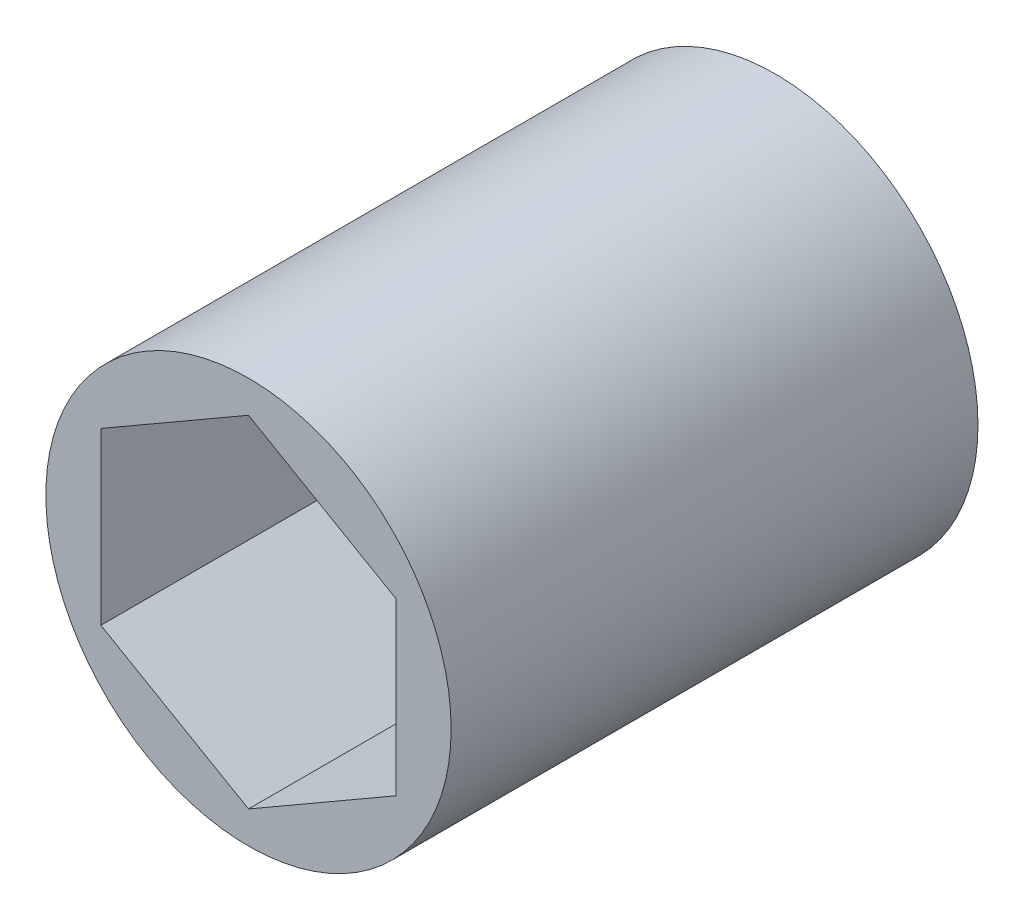
ISO-10303-21;
HEADER;
FILE_DESCRIPTION(('STEP AP214'),'2;1');
FILE_NAME('part.step','',(''),(''),'','','');
FILE_SCHEMA(('AUTOMOTIVE_DESIGN { 1 0 10303 214 1 1 1 1 }'));
ENDSEC;
DATA;
#1=APPLICATION_CONTEXT('core data for automotive mechanical design processes');
#2=APPLICATION_PROTOCOL_DEFINITION('international standard','automotive_design',2000,#1);
#3=PRODUCT_CONTEXT('',#1,'mechanical');
#4=PRODUCT('Part','Part','',(#3));
#5=PRODUCT_RELATED_PRODUCT_CATEGORY('part','',(#4));
#6=PRODUCT_DEFINITION_FORMATION('','',#4);
#7=PRODUCT_DEFINITION_CONTEXT('part definition',#1,'design');
#8=PRODUCT_DEFINITION('design','',#6,#7);
#9=PRODUCT_DEFINITION_SHAPE('','',#8);
#10=(LENGTH_UNIT() NAMED_UNIT(*) SI_UNIT(.MILLI.,.METRE.));
#11=(NAMED_UNIT(*) PLANE_ANGLE_UNIT() SI_UNIT($,.RADIAN.));
#12=(NAMED_UNIT(*) SI_UNIT($,.STERADIAN.) SOLID_ANGLE_UNIT());
#13=UNCERTAINTY_MEASURE_WITH_UNIT(LENGTH_MEASURE(1.E-05),#10,'distance_accuracy_value','');
#14=(GEOMETRIC_REPRESENTATION_CONTEXT(3) GLOBAL_UNCERTAINTY_ASSIGNED_CONTEXT((#13)) GLOBAL_UNIT_ASSIGNED_CONTEXT((#10,
#11,#12)) REPRESENTATION_CONTEXT('',''));
#15=CARTESIAN_POINT('',(0.,0.,0.));
#16=DIRECTION('',(0.,0.,1.));
#17=DIRECTION('',(1.,0.,0.));
#18=AXIS2_PLACEMENT_3D('',#15,#16,#17);
#19=CARTESIAN_POINT('',(0.,0.,23.114));
#20=DIRECTION('',(0.,0.,1.));
#21=DIRECTION('',(1.,0.,0.));
#22=AXIS2_PLACEMENT_3D('',#19,#20,#21);
#23=PLANE('',#22);
#24=CARTESIAN_POINT('',(0.,0.,23.114));
#25=DIRECTION('',(0.,0.,1.));
#26=DIRECTION('',(1.,0.,0.));
#27=AXIS2_PLACEMENT_3D('',#24,#25,#26);
#28=CIRCLE('',#27,8.89);
#29=CARTESIAN_POINT('',(8.89,0.,23.114));
#30=VERTEX_POINT('',#29);
#31=EDGE_CURVE('E11',#30,#30,#28,.T.);
#32=ORIENTED_EDGE('',*,*,#31,.T.);
#33=EDGE_LOOP('',(#32));
#34=FACE_BOUND('',#33,.T.);
#35=DIRECTION('',(-0.866025403784439,-0.5,0.));
#36=VECTOR('',#35,1.);
#37=CARTESIAN_POINT('',(0.,7.47899538708242,23.114));
#38=LINE('',#37,#36);
#39=CARTESIAN_POINT('',(0.,7.47899538708242,23.114));
#40=VERTEX_POINT('',#39);
#41=CARTESIAN_POINT('',(-6.477,3.73949769354121,23.114));
#42=VERTEX_POINT('',#41);
#43=EDGE_CURVE('E93',#40,#42,#38,.T.);
#44=ORIENTED_EDGE('',*,*,#43,.F.);
#45=DIRECTION('',(-0.866025403784439,0.5,0.));
#46=VECTOR('',#45,1.);
#47=CARTESIAN_POINT('',(6.477,3.73949769354121,23.114));
#48=LINE('',#47,#46);
#49=CARTESIAN_POINT('',(6.477,3.73949769354121,23.114));
#50=VERTEX_POINT('',#49);
#51=EDGE_CURVE('E85',#50,#40,#48,.T.);
#52=ORIENTED_EDGE('',*,*,#51,.F.);
#53=DIRECTION('',(0.,1.,0.));
#54=VECTOR('',#53,1.);
#55=CARTESIAN_POINT('',(6.477,-3.73949769354121,23.114));
#56=LINE('',#55,#54);
#57=CARTESIAN_POINT('',(6.477,-3.73949769354121,23.114));
#58=VERTEX_POINT('',#57);
#59=EDGE_CURVE('E113',#58,#50,#56,.T.);
#60=ORIENTED_EDGE('',*,*,#59,.F.);
#61=DIRECTION('',(0.866025403784439,0.5,0.));
#62=VECTOR('',#61,1.);
#63=CARTESIAN_POINT('',(0.,-7.47899538708241,23.114));
#64=LINE('',#63,#62);
#65=CARTESIAN_POINT('',(0.,-7.47899538708241,23.114));
#66=VERTEX_POINT('',#65);
#67=EDGE_CURVE('E111',#66,#58,#64,.T.);
#68=ORIENTED_EDGE('',*,*,#67,.F.);
#69=DIRECTION('',(0.866025403784439,-0.5,0.));
#70=VECTOR('',#69,1.);
#71=CARTESIAN_POINT('',(-6.477,-3.73949769354121,23.114));
#72=LINE('',#71,#70);
#73=CARTESIAN_POINT('',(-6.477,-3.73949769354121,23.114));
#74=VERTEX_POINT('',#73);
#75=EDGE_CURVE('E107',#74,#66,#72,.T.);
#76=ORIENTED_EDGE('',*,*,#75,.F.);
#77=DIRECTION('',(0.,-1.,0.));
#78=VECTOR('',#77,1.);
#79=CARTESIAN_POINT('',(-6.477,3.73949769354121,23.114));
#80=LINE('',#79,#78);
#81=EDGE_CURVE('E105',#42,#74,#80,.T.);
#82=ORIENTED_EDGE('',*,*,#81,.F.);
#83=EDGE_LOOP('',(#44,#52,#60,#68,#76,#82));
#84=FACE_BOUND('',#83,.T.);
#85=ADVANCED_FACE('F32',(#34,#84),#23,.T.);
#86=CARTESIAN_POINT('',(0.,0.,0.));
#87=DIRECTION('',(0.,0.,1.));
#88=DIRECTION('',(1.,0.,0.));
#89=AXIS2_PLACEMENT_3D('',#86,#87,#88);
#90=PLANE('',#89);
#91=CARTESIAN_POINT('',(0.,0.,0.));
#92=DIRECTION('',(0.,0.,1.));
#93=DIRECTION('',(1.,0.,0.));
#94=AXIS2_PLACEMENT_3D('',#91,#92,#93);
#95=CIRCLE('',#94,8.89);
#96=CARTESIAN_POINT('',(8.89,0.,0.));
#97=VERTEX_POINT('',#96);
#98=EDGE_CURVE('E36',#97,#97,#95,.T.);
#99=ORIENTED_EDGE('',*,*,#98,.F.);
#100=EDGE_LOOP('',(#99));
#101=FACE_BOUND('',#100,.T.);
#102=DIRECTION('',(-0.866025403784439,0.5,0.));
#103=VECTOR('',#102,1.);
#104=CARTESIAN_POINT('',(6.477,3.73949769354121,0.));
#105=LINE('',#104,#103);
#106=CARTESIAN_POINT('',(6.477,3.73949769354121,0.));
#107=VERTEX_POINT('',#106);
#108=CARTESIAN_POINT('',(0.,7.47899538708242,0.));
#109=VERTEX_POINT('',#108);
#110=EDGE_CURVE('E55',#107,#109,#105,.T.);
#111=ORIENTED_EDGE('',*,*,#110,.T.);
#112=DIRECTION('',(-0.866025403784439,-0.5,0.));
#113=VECTOR('',#112,1.);
#114=CARTESIAN_POINT('',(0.,7.47899538708242,0.));
#115=LINE('',#114,#113);
#116=CARTESIAN_POINT('',(-6.477,3.73949769354121,0.));
#117=VERTEX_POINT('',#116);
#118=EDGE_CURVE('E100',#109,#117,#115,.T.);
#119=ORIENTED_EDGE('',*,*,#118,.T.);
#120=DIRECTION('',(0.,-1.,0.));
#121=VECTOR('',#120,1.);
#122=CARTESIAN_POINT('',(-6.477,3.73949769354121,0.));
#123=LINE('',#122,#121);
#124=CARTESIAN_POINT('',(-6.477,-3.73949769354121,0.));
#125=VERTEX_POINT('',#124);
#126=EDGE_CURVE('E117',#117,#125,#123,.T.);
#127=ORIENTED_EDGE('',*,*,#126,.T.);
#128=DIRECTION('',(0.866025403784439,-0.5,0.));
#129=VECTOR('',#128,1.);
#130=CARTESIAN_POINT('',(-6.477,-3.73949769354121,0.));
#131=LINE('',#130,#129);
#132=CARTESIAN_POINT('',(0.,-7.47899538708241,0.));
#133=VERTEX_POINT('',#132);
#134=EDGE_CURVE('E120',#125,#133,#131,.T.);
#135=ORIENTED_EDGE('',*,*,#134,.T.);
#136=DIRECTION('',(0.866025403784439,0.5,0.));
#137=VECTOR('',#136,1.);
#138=CARTESIAN_POINT('',(0.,-7.47899538708241,0.));
#139=LINE('',#138,#137);
#140=CARTESIAN_POINT('',(6.477,-3.73949769354121,0.));
#141=VERTEX_POINT('',#140);
#142=EDGE_CURVE('E123',#133,#141,#139,.T.);
#143=ORIENTED_EDGE('',*,*,#142,.T.);
#144=DIRECTION('',(0.,1.,0.));
#145=VECTOR('',#144,1.);
#146=CARTESIAN_POINT('',(6.477,-3.73949769354121,0.));
#147=LINE('',#146,#145);
#148=EDGE_CURVE('E94',#141,#107,#147,.T.);
#149=ORIENTED_EDGE('',*,*,#148,.T.);
#150=EDGE_LOOP('',(#111,#119,#127,#135,#143,#149));
#151=FACE_BOUND('',#150,.T.);
#152=ADVANCED_FACE('F140',(#101,#151),#90,.F.);
#153=CARTESIAN_POINT('',(0.,0.,23.114));
#154=DIRECTION('',(0.,0.,-1.));
#155=DIRECTION('',(-1.,0.,0.));
#156=AXIS2_PLACEMENT_3D('',#153,#154,#155);
#157=CYLINDRICAL_SURFACE('',#156,8.89);
#158=ORIENTED_EDGE('',*,*,#31,.F.);
#159=EDGE_LOOP('',(#158));
#160=FACE_BOUND('',#159,.T.);
#161=ORIENTED_EDGE('',*,*,#98,.T.);
#162=EDGE_LOOP('',(#161));
#163=FACE_BOUND('',#162,.T.);
#164=ADVANCED_FACE('F34',(#160,#163),#157,.T.);
#165=CARTESIAN_POINT('',(6.477,3.73949769354121,23.114));
#166=DIRECTION('',(-0.5,-0.866025403784439,0.));
#167=DIRECTION('',(0.866025403784439,-0.5,0.));
#168=AXIS2_PLACEMENT_3D('',#165,#166,#167);
#169=PLANE('',#168);
#170=ORIENTED_EDGE('',*,*,#110,.F.);
#171=DIRECTION('',(0.,0.,-1.));
#172=VECTOR('',#171,1.);
#173=CARTESIAN_POINT('',(6.477,3.73949769354121,23.114));
#174=LINE('',#173,#172);
#175=EDGE_CURVE('E89',#50,#107,#174,.T.);
#176=ORIENTED_EDGE('',*,*,#175,.F.);
#177=ORIENTED_EDGE('',*,*,#51,.T.);
#178=DIRECTION('',(0.,0.,-1.));
#179=VECTOR('',#178,1.);
#180=CARTESIAN_POINT('',(0.,7.47899538708242,23.114));
#181=LINE('',#180,#179);
#182=EDGE_CURVE('E88',#40,#109,#181,.T.);
#183=ORIENTED_EDGE('',*,*,#182,.T.);
#184=EDGE_LOOP('',(#170,#176,#177,#183));
#185=FACE_BOUND('',#184,.T.);
#186=ADVANCED_FACE('F87',(#185),#169,.T.);
#187=CARTESIAN_POINT('',(0.,7.47899538708242,23.114));
#188=DIRECTION('',(0.5,-0.866025403784439,0.));
#189=DIRECTION('',(0.866025403784439,0.5,0.));
#190=AXIS2_PLACEMENT_3D('',#187,#188,#189);
#191=PLANE('',#190);
#192=ORIENTED_EDGE('',*,*,#118,.F.);
#193=ORIENTED_EDGE('',*,*,#182,.F.);
#194=ORIENTED_EDGE('',*,*,#43,.T.);
#195=DIRECTION('',(0.,0.,-1.));
#196=VECTOR('',#195,1.);
#197=CARTESIAN_POINT('',(-6.477,3.73949769354121,23.114));
#198=LINE('',#197,#196);
#199=EDGE_CURVE('E101',#42,#117,#198,.T.);
#200=ORIENTED_EDGE('',*,*,#199,.T.);
#201=EDGE_LOOP('',(#192,#193,#194,#200));
#202=FACE_BOUND('',#201,.T.);
#203=ADVANCED_FACE('F97',(#202),#191,.T.);
#204=CARTESIAN_POINT('',(-6.477,3.73949769354121,23.114));
#205=DIRECTION('',(1.,0.,0.));
#206=DIRECTION('',(0.,0.,-1.));
#207=AXIS2_PLACEMENT_3D('',#204,#205,#206);
#208=PLANE('',#207);
#209=ORIENTED_EDGE('',*,*,#126,.F.);
#210=ORIENTED_EDGE('',*,*,#199,.F.);
#211=ORIENTED_EDGE('',*,*,#81,.T.);
#212=DIRECTION('',(0.,0.,-1.));
#213=VECTOR('',#212,1.);
#214=CARTESIAN_POINT('',(-6.477,-3.73949769354121,23.114));
#215=LINE('',#214,#213);
#216=EDGE_CURVE('E132',#74,#125,#215,.T.);
#217=ORIENTED_EDGE('',*,*,#216,.T.);
#218=EDGE_LOOP('',(#209,#210,#211,#217));
#219=FACE_BOUND('',#218,.T.);
#220=ADVANCED_FACE('F136',(#219),#208,.T.);
#221=CARTESIAN_POINT('',(-6.477,-3.73949769354121,23.114));
#222=DIRECTION('',(0.5,0.866025403784439,0.));
#223=DIRECTION('',(-0.866025403784439,0.5,0.));
#224=AXIS2_PLACEMENT_3D('',#221,#222,#223);
#225=PLANE('',#224);
#226=ORIENTED_EDGE('',*,*,#134,.F.);
#227=ORIENTED_EDGE('',*,*,#216,.F.);
#228=ORIENTED_EDGE('',*,*,#75,.T.);
#229=DIRECTION('',(0.,0.,-1.));
#230=VECTOR('',#229,1.);
#231=CARTESIAN_POINT('',(0.,-7.47899538708241,23.114));
#232=LINE('',#231,#230);
#233=EDGE_CURVE('E130',#66,#133,#232,.T.);
#234=ORIENTED_EDGE('',*,*,#233,.T.);
#235=EDGE_LOOP('',(#226,#227,#228,#234));
#236=FACE_BOUND('',#235,.T.);
#237=ADVANCED_FACE('F148',(#236),#225,.T.);
#238=CARTESIAN_POINT('',(0.,-7.47899538708241,23.114));
#239=DIRECTION('',(-0.5,0.866025403784439,0.));
#240=DIRECTION('',(-0.866025403784439,-0.5,0.));
#241=AXIS2_PLACEMENT_3D('',#238,#239,#240);
#242=PLANE('',#241);
#243=ORIENTED_EDGE('',*,*,#142,.F.);
#244=ORIENTED_EDGE('',*,*,#233,.F.);
#245=ORIENTED_EDGE('',*,*,#67,.T.);
#246=DIRECTION('',(0.,0.,-1.));
#247=VECTOR('',#246,1.);
#248=CARTESIAN_POINT('',(6.477,-3.73949769354121,23.114));
#249=LINE('',#248,#247);
#250=EDGE_CURVE('E47',#58,#141,#249,.T.);
#251=ORIENTED_EDGE('',*,*,#250,.T.);
#252=EDGE_LOOP('',(#243,#244,#245,#251));
#253=FACE_BOUND('',#252,.T.);
#254=ADVANCED_FACE('F146',(#253),#242,.T.);
#255=CARTESIAN_POINT('',(6.477,-3.73949769354121,23.114));
#256=DIRECTION('',(-1.,0.,0.));
#257=DIRECTION('',(0.,-1.,0.));
#258=AXIS2_PLACEMENT_3D('',#255,#256,#257);
#259=PLANE('',#258);
#260=ORIENTED_EDGE('',*,*,#148,.F.);
#261=ORIENTED_EDGE('',*,*,#250,.F.);
#262=ORIENTED_EDGE('',*,*,#59,.T.);
#263=ORIENTED_EDGE('',*,*,#175,.T.);
#264=EDGE_LOOP('',(#260,#261,#262,#263));
#265=FACE_BOUND('',#264,.T.);
#266=ADVANCED_FACE('F142',(#265),#259,.T.);
#267=CLOSED_SHELL('',(#85,#152,#164,#186,#203,#220,#237,#254,#266));
#268=MANIFOLD_SOLID_BREP('B2',#267);
#269=ADVANCED_BREP_SHAPE_REPRESENTATION('',(#18,#268),#14);
#270=SHAPE_DEFINITION_REPRESENTATION(#9,#269);
ENDSEC;
END-ISO-10303-21;
